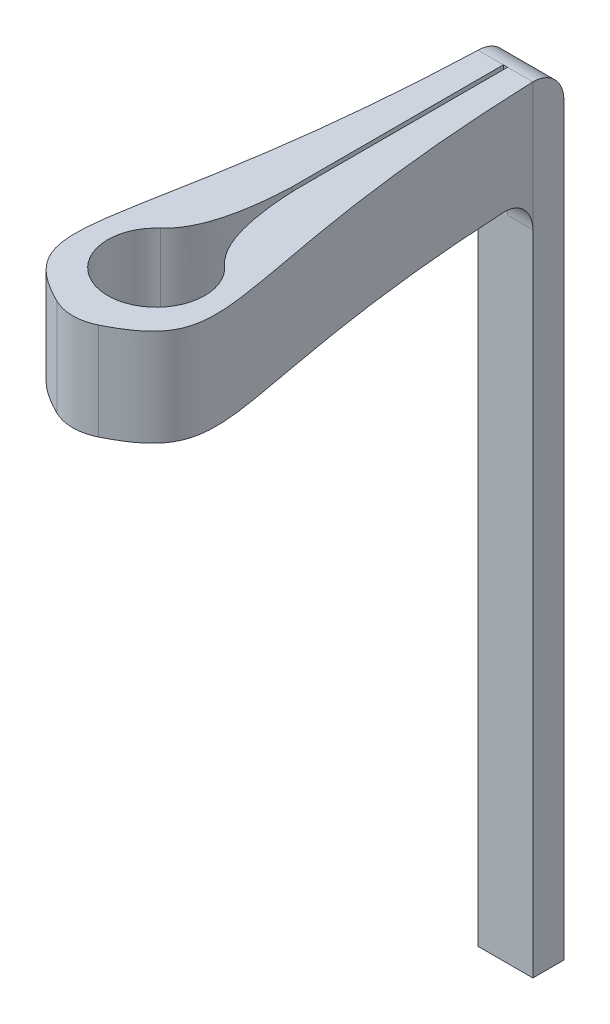
ISO-10303-21;
HEADER;
FILE_DESCRIPTION(('STEP AP214'),'2;1');
FILE_NAME('part.step','',(''),(''),'','','');
FILE_SCHEMA(('AUTOMOTIVE_DESIGN { 1 0 10303 214 1 1 1 1 }'));
ENDSEC;
DATA;
#1=APPLICATION_CONTEXT('core data for automotive mechanical design processes');
#2=APPLICATION_PROTOCOL_DEFINITION('international standard','automotive_design',2000,#1);
#3=PRODUCT_CONTEXT('',#1,'mechanical');
#4=PRODUCT('Part','Part','',(#3));
#5=PRODUCT_RELATED_PRODUCT_CATEGORY('part','',(#4));
#6=PRODUCT_DEFINITION_FORMATION('','',#4);
#7=PRODUCT_DEFINITION_CONTEXT('part definition',#1,'design');
#8=PRODUCT_DEFINITION('design','',#6,#7);
#9=PRODUCT_DEFINITION_SHAPE('','',#8);
#10=(LENGTH_UNIT() NAMED_UNIT(*) SI_UNIT(.MILLI.,.METRE.));
#11=(NAMED_UNIT(*) PLANE_ANGLE_UNIT() SI_UNIT($,.RADIAN.));
#12=(NAMED_UNIT(*) SI_UNIT($,.STERADIAN.) SOLID_ANGLE_UNIT());
#13=UNCERTAINTY_MEASURE_WITH_UNIT(LENGTH_MEASURE(1.E-05),#10,'distance_accuracy_value','');
#14=(GEOMETRIC_REPRESENTATION_CONTEXT(3) GLOBAL_UNCERTAINTY_ASSIGNED_CONTEXT((#13)) GLOBAL_UNIT_ASSIGNED_CONTEXT((#10,
#11,#12)) REPRESENTATION_CONTEXT('',''));
#15=CARTESIAN_POINT('',(0.,0.,0.));
#16=DIRECTION('',(0.,0.,1.));
#17=DIRECTION('',(1.,0.,0.));
#18=AXIS2_PLACEMENT_3D('',#15,#16,#17);
#19=CARTESIAN_POINT('',(0.895808533337032,-1.5875,-13.1387117385729));
#20=CARTESIAN_POINT('',(1.21007447279534,-1.5875,-4.57087153008787));
#21=CARTESIAN_POINT('',(2.7776087579068,-1.5875,-1.08356263840888));
#22=CARTESIAN_POINT('',(3.2771361570606,-1.5875,-0.201945645477048));
#23=CARTESIAN_POINT('',(0.,-1.5875,1.16995363792198));
#24=B_SPLINE_CURVE_WITH_KNOTS('',4,(#19,#20,#21,#22,#23),.UNSPECIFIED.,.F.,.F.,(5,5),(0.,1.),.UNSPECIFIED.);
#25=DIRECTION('',(0.,1.,0.));
#26=VECTOR('',#25,1.);
#27=SURFACE_OF_LINEAR_EXTRUSION('',#24,#26);
#28=CARTESIAN_POINT('',(0.895808533337032,1.5875,-13.1387117385729));
#29=CARTESIAN_POINT('',(1.21007447279534,1.5875,-4.57087153008787));
#30=CARTESIAN_POINT('',(2.7776087579068,1.5875,-1.08356263840888));
#31=CARTESIAN_POINT('',(3.2771361570606,1.5875,-0.201945645477048));
#32=CARTESIAN_POINT('',(0.,1.5875,1.16995363792198));
#33=B_SPLINE_CURVE_WITH_KNOTS('',4,(#28,#29,#30,#31,#32),.UNSPECIFIED.,.F.,.F.,(5,5),(0.,1.),.UNSPECIFIED.);
#34=CARTESIAN_POINT('',(0.895808533337032,1.5875,-13.1387117385729));
#35=VERTEX_POINT('',#34);
#36=CARTESIAN_POINT('',(0.677507544986384,1.5875,0.863468623555458));
#37=VERTEX_POINT('',#36);
#38=EDGE_CURVE('E181',#35,#37,#33,.T.);
#39=ORIENTED_EDGE('',*,*,#38,.T.);
#40=DIRECTION('',(0.,1.,0.));
#41=VECTOR('',#40,1.);
#42=CARTESIAN_POINT('',(0.677507544986435,1.5875,0.863468623555433));
#43=LINE('',#42,#41);
#44=CARTESIAN_POINT('',(0.677507544986384,-1.5875,0.863468623555458));
#45=VERTEX_POINT('',#44);
#46=EDGE_CURVE('E315',#37,#45,#43,.F.);
#47=ORIENTED_EDGE('',*,*,#46,.T.);
#48=CARTESIAN_POINT('',(0.940817771257643,-1.5875,-12.1227117385979));
#49=VERTEX_POINT('',#48);
#50=EDGE_CURVE('E219',#49,#45,#24,.T.);
#51=ORIENTED_EDGE('',*,*,#50,.F.);
#52=CARTESIAN_POINT('',(0.940817770777522,-1.5875,-12.1227117385729));
#53=CARTESIAN_POINT('',(0.939328600907444,-1.58750022204157,-12.1513079520232));
#54=CARTESIAN_POINT('',(0.93785946140498,-1.58870806349856,-12.1798915074532));
#55=CARTESIAN_POINT('',(0.934969141549042,-1.59352728075537,-12.2368564827357));
#56=CARTESIAN_POINT('',(0.933547959222119,-1.59713855752622,-12.2652379108677));
#57=CARTESIAN_POINT('',(0.929372489614877,-1.61154468895069,-12.3497267497475));
#58=CARTESIAN_POINT('',(0.926701444796436,-1.62591193266797,-12.4052717238406));
#59=CARTESIAN_POINT('',(0.921643753745075,-1.66377972410457,-12.51316937762));
#60=CARTESIAN_POINT('',(0.919257252531395,-1.68728490324401,-12.5655204229221));
#61=CARTESIAN_POINT('',(0.914807242295324,-1.74276538676793,-12.6655367231498));
#62=CARTESIAN_POINT('',(0.912743671302016,-1.77473906285321,-12.7132028764604));
#63=CARTESIAN_POINT('',(0.908964344849778,-1.84621844603389,-12.8024541281653));
#64=CARTESIAN_POINT('',(0.90724834479178,-1.88571881804383,-12.8440434972439));
#65=CARTESIAN_POINT('',(0.904172769237229,-1.97117878853448,-12.9200134206932));
#66=CARTESIAN_POINT('',(0.90281318548842,-2.01713823742763,-12.9543941419651));
#67=CARTESIAN_POINT('',(0.901044949174675,-2.08986741994529,-12.9997850900849));
#68=CARTESIAN_POINT('',(0.900500579509933,-2.11475181333681,-13.0138893566973));
#69=CARTESIAN_POINT('',(0.899501998730722,-2.16559629009388,-13.0399423328207));
#70=CARTESIAN_POINT('',(0.899047707887298,-2.19155539740104,-13.0518929476717));
#71=CARTESIAN_POINT('',(0.897819342422165,-2.27080393556553,-13.0843873593775));
#72=CARTESIAN_POINT('',(0.897178549331054,-2.32551572997143,-13.101605585224));
#73=CARTESIAN_POINT('',(0.896412642565198,-2.41771298811855,-13.1222827675783));
#74=CARTESIAN_POINT('',(0.896185875363191,-2.45462540078673,-13.1284396437794));
#75=CARTESIAN_POINT('',(0.895884062655519,-2.52885104385581,-13.136652425781));
#76=CARTESIAN_POINT('',(0.895808801597605,-2.56616362877481,-13.1387141578079));
#77=CARTESIAN_POINT('',(0.895808533337032,-2.6035,-13.1387117385729));
#78=B_SPLINE_CURVE_WITH_KNOTS('',3,(#52,#53,#54,#55,#56,#57,#58,#59,#60,#61,#62,#63,#64,#65,#66,
#67,#68,#69,#70,#71,#72,#73,#74,#75,#76,#77),.UNSPECIFIED.,.F.,.F.,(4,2,2,2,2,2,2,2,2,2,2,2,4),
(0.,0.0858522069243643,0.171700876690702,0.343122365469708,0.514630850066166,0.68610638139503,
0.857460816266934,1.02881128334724,1.11454841588172,1.20020932019451,1.37135254542086,
1.4834174901905,1.59532288386267),.UNSPECIFIED.);
#79=CARTESIAN_POINT('',(0.895808533337032,-2.6035,-13.1387117385729));
#80=VERTEX_POINT('',#79);
#81=EDGE_CURVE('E364',#49,#80,#78,.T.);
#82=ORIENTED_EDGE('',*,*,#81,.T.);
#83=DIRECTION('',(0.,1.,0.));
#84=VECTOR('',#83,1.);
#85=CARTESIAN_POINT('',(0.895808533337032,-1.5875,-13.1387117385729));
#86=LINE('',#85,#84);
#87=EDGE_CURVE('E55',#80,#35,#86,.T.);
#88=ORIENTED_EDGE('',*,*,#87,.T.);
#89=EDGE_LOOP('',(#39,#47,#51,#82,#88));
#90=FACE_BOUND('',#89,.T.);
#91=ADVANCED_FACE('F34',(#90),#27,.F.);
#92=CARTESIAN_POINT('',(-0.895808533337031,-1.5875,-13.1387117385729));
#93=CARTESIAN_POINT('',(-1.21007447279534,-1.5875,-4.57087153008787));
#94=CARTESIAN_POINT('',(-2.7776087579068,-1.5875,-1.08356263840888));
#95=CARTESIAN_POINT('',(-3.2771361570606,-1.5875,-0.201945645477048));
#96=CARTESIAN_POINT('',(0.,-1.5875,1.16995363792198));
#97=B_SPLINE_CURVE_WITH_KNOTS('',4,(#92,#93,#94,#95,#96),.UNSPECIFIED.,.F.,.F.,(5,5),(0.,1.),.UNSPECIFIED.);
#98=DIRECTION('',(0.,1.,0.));
#99=VECTOR('',#98,1.);
#100=SURFACE_OF_LINEAR_EXTRUSION('',#97,#99);
#101=DIRECTION('',(0.,1.,0.));
#102=VECTOR('',#101,1.);
#103=CARTESIAN_POINT('',(-0.895808533337031,-1.5875,-13.1387117385729));
#104=LINE('',#103,#102);
#105=CARTESIAN_POINT('',(-0.895808533337031,-2.6035,-13.1387117385729));
#106=VERTEX_POINT('',#105);
#107=CARTESIAN_POINT('',(-0.895808533337031,1.5875,-13.1387117385729));
#108=VERTEX_POINT('',#107);
#109=EDGE_CURVE('E338',#106,#108,#104,.T.);
#110=ORIENTED_EDGE('',*,*,#109,.F.);
#111=CARTESIAN_POINT('',(-0.895808533337031,-2.6035,-13.1387117385729));
#112=CARTESIAN_POINT('',(-0.895808644521803,-2.57493082215817,-13.138711544934));
#113=CARTESIAN_POINT('',(-0.895852749616112,-2.54637534498942,-13.1375059587632));
#114=CARTESIAN_POINT('',(-0.8960293760861,-2.48946876532865,-13.1326964350414));
#115=CARTESIAN_POINT('',(-0.896161893251777,-2.46111765317017,-13.1290926116894));
#116=CARTESIAN_POINT('',(-0.896692122889837,-2.37672593210134,-13.1147182255634));
#117=CARTESIAN_POINT('',(-0.897222511499748,-2.32125069622909,-13.1003846504929));
#118=CARTESIAN_POINT('',(-0.898639752593142,-2.21349767100376,-13.062615877911));
#119=CARTESIAN_POINT('',(-0.899526774793042,-2.1612214176636,-13.0391763471955));
#120=CARTESIAN_POINT('',(-0.901659536102315,-2.06134822821983,-12.9838637587255));
#121=CARTESIAN_POINT('',(-0.902905213284322,-2.01375048619993,-12.9519921569764));
#122=CARTESIAN_POINT('',(-0.905754096178373,-1.92457328936663,-12.8807197751934));
#123=CARTESIAN_POINT('',(-0.90735741181802,-1.88299569146331,-12.841316680733));
#124=CARTESIAN_POINT('',(-0.910914628002094,-1.8070333732752,-12.7560769076421));
#125=CARTESIAN_POINT('',(-0.912868525221261,-1.77264858477344,-12.7102402900345));
#126=CARTESIAN_POINT('',(-0.916046154230379,-1.72720747571318,-12.6376748721264));
#127=CARTESIAN_POINT('',(-0.917147881131955,-1.71307061112935,-12.612821033248));
#128=CARTESIAN_POINT('',(-0.91942893394455,-1.68695104376555,-12.5620395102616));
#129=CARTESIAN_POINT('',(-0.920608189875637,-1.67496643379838,-12.536112802183));
#130=CARTESIAN_POINT('',(-0.924257339092153,-1.64236563386945,-12.4569627280144));
#131=CARTESIAN_POINT('',(-0.926840763556043,-1.62507157727108,-12.4023199715406));
#132=CARTESIAN_POINT('',(-0.931331467141856,-1.60418275921374,-12.3099181168085));
#133=CARTESIAN_POINT('',(-0.933170568992069,-1.59793047249544,-12.2727244503796));
#134=CARTESIAN_POINT('',(-0.936934076125651,-1.58959077551676,-12.1979312915133));
#135=CARTESIAN_POINT('',(-0.938858355772612,-1.58749742722677,-12.1603324548522));
#136=CARTESIAN_POINT('',(-0.94081777125773,-1.5875,-12.1227117385963));
#137=B_SPLINE_CURVE_WITH_KNOTS('',3,(#111,#112,#113,#114,#115,#116,#117,#118,#119,#120,#121,
#122,#123,#124,#125,#126,#127,#128,#129,#130,#131,#132,#133,#134,#135,#136),.UNSPECIFIED.,.F.,
.F.,(4,2,2,2,2,2,2,2,2,2,2,2,4),(0.,0.0856548572810295,0.171305636144386,0.34232214208756,
0.513420128655629,0.684488590190824,0.855609705801621,1.02672919841746,1.11248320510674,
1.19816084316029,1.36934325509694,1.48241519898036,1.59532558518064),.UNSPECIFIED.);
#138=CARTESIAN_POINT('',(-0.940817771257643,-1.5875,-12.1227117385979));
#139=VERTEX_POINT('',#138);
#140=EDGE_CURVE('E11',#106,#139,#137,.T.);
#141=ORIENTED_EDGE('',*,*,#140,.T.);
#142=CARTESIAN_POINT('',(-0.677507544986381,-1.5875,0.863468623555459));
#143=VERTEX_POINT('',#142);
#144=EDGE_CURVE('E242',#139,#143,#97,.T.);
#145=ORIENTED_EDGE('',*,*,#144,.T.);
#146=DIRECTION('',(0.,1.,0.));
#147=VECTOR('',#146,1.);
#148=CARTESIAN_POINT('',(-0.677507544986433,-1.5875,0.863468623555434));
#149=LINE('',#148,#147);
#150=CARTESIAN_POINT('',(-0.677507544986381,1.5875,0.863468623555459));
#151=VERTEX_POINT('',#150);
#152=EDGE_CURVE('E330',#143,#151,#149,.T.);
#153=ORIENTED_EDGE('',*,*,#152,.T.);
#154=CARTESIAN_POINT('',(-0.895808533337031,1.5875,-13.1387117385729));
#155=CARTESIAN_POINT('',(-1.21007447279534,1.5875,-4.57087153008787));
#156=CARTESIAN_POINT('',(-2.7776087579068,1.5875,-1.08356263840888));
#157=CARTESIAN_POINT('',(-3.2771361570606,1.5875,-0.201945645477048));
#158=CARTESIAN_POINT('',(0.,1.5875,1.16995363792198));
#159=B_SPLINE_CURVE_WITH_KNOTS('',4,(#154,#155,#156,#157,#158),.UNSPECIFIED.,.F.,.F.,(5,5),(0.,
1.),.UNSPECIFIED.);
#160=EDGE_CURVE('E214',#108,#151,#159,.T.);
#161=ORIENTED_EDGE('',*,*,#160,.F.);
#162=EDGE_LOOP('',(#110,#141,#145,#153,#161));
#163=FACE_BOUND('',#162,.T.);
#164=ADVANCED_FACE('F260',(#163),#100,.T.);
#165=CARTESIAN_POINT('',(-0.0682967636124147,-1.5875,0.));
#166=DIRECTION('',(-1.,0.,0.));
#167=DIRECTION('',(0.,0.,1.));
#168=AXIS2_PLACEMENT_3D('',#165,#166,#167);
#169=PLANE('',#168);
#170=DIRECTION('',(0.,1.,0.));
#171=VECTOR('',#170,1.);
#172=CARTESIAN_POINT('',(-0.0682967636124164,-1.5875,-13.1387117385729));
#173=LINE('',#172,#171);
#174=CARTESIAN_POINT('',(-0.0682967636124164,-2.6035,-13.1387117385729));
#175=VERTEX_POINT('',#174);
#176=CARTESIAN_POINT('',(-0.0682967636124159,1.5875,-13.1387117385729));
#177=VERTEX_POINT('',#176);
#178=EDGE_CURVE('E254',#175,#177,#173,.T.);
#179=ORIENTED_EDGE('',*,*,#178,.T.);
#180=DIRECTION('',(0.,0.,1.));
#181=VECTOR('',#180,1.);
#182=CARTESIAN_POINT('',(-0.0682967636124147,1.5875,0.));
#183=LINE('',#182,#181);
#184=CARTESIAN_POINT('',(-0.0682967636124155,1.5875,-6.21461869480893));
#185=VERTEX_POINT('',#184);
#186=EDGE_CURVE('E208',#177,#185,#183,.T.);
#187=ORIENTED_EDGE('',*,*,#186,.T.);
#188=DIRECTION('',(0.,1.,0.));
#189=VECTOR('',#188,1.);
#190=CARTESIAN_POINT('',(-0.0682967636124155,-1.5875,-6.21461869480893));
#191=LINE('',#190,#189);
#192=CARTESIAN_POINT('',(-0.0682967636124155,-1.5875,-6.21461869480893));
#193=VERTEX_POINT('',#192);
#194=EDGE_CURVE('E391',#193,#185,#191,.T.);
#195=ORIENTED_EDGE('',*,*,#194,.F.);
#196=DIRECTION('',(0.,0.,1.));
#197=VECTOR('',#196,1.);
#198=CARTESIAN_POINT('',(-0.0682967636124147,-1.5875,0.));
#199=LINE('',#198,#197);
#200=CARTESIAN_POINT('',(-0.0682967636124162,-1.5875,-12.1227117385729));
#201=VERTEX_POINT('',#200);
#202=EDGE_CURVE('E245',#201,#193,#199,.T.);
#203=ORIENTED_EDGE('',*,*,#202,.F.);
#204=CARTESIAN_POINT('',(-0.0682967636124162,-2.6035,-12.1227117385729));
#205=DIRECTION('',(-1.,0.,0.));
#206=DIRECTION('',(0.,0.,1.));
#207=AXIS2_PLACEMENT_3D('',#204,#205,#206);
#208=CIRCLE('',#207,1.016);
#209=EDGE_CURVE('E48',#201,#175,#208,.T.);
#210=ORIENTED_EDGE('',*,*,#209,.T.);
#211=EDGE_LOOP('',(#179,#187,#195,#203,#210));
#212=FACE_BOUND('',#211,.T.);
#213=ADVANCED_FACE('F265',(#212),#169,.F.);
#214=CARTESIAN_POINT('',(-1.05409896108141,-1.5875,-2.89573812001823));
#215=CARTESIAN_POINT('',(-0.161537853761285,-1.5875,-3.68834707179423));
#216=CARTESIAN_POINT('',(-0.0682967636124155,-1.5875,-6.21461869480893));
#217=B_SPLINE_CURVE_WITH_KNOTS('',2,(#214,#215,#216),.UNSPECIFIED.,.F.,.F.,(3,3),(0.,1.),.UNSPECIFIED.);
#218=DIRECTION('',(0.,1.,0.));
#219=VECTOR('',#218,1.);
#220=SURFACE_OF_LINEAR_EXTRUSION('',#217,#219);
#221=ORIENTED_EDGE('',*,*,#194,.T.);
#222=CARTESIAN_POINT('',(-1.05409896108141,1.5875,-2.89573812001823));
#223=CARTESIAN_POINT('',(-0.161537853761285,1.5875,-3.68834707179423));
#224=CARTESIAN_POINT('',(-0.0682967636124155,1.5875,-6.21461869480893));
#225=B_SPLINE_CURVE_WITH_KNOTS('',2,(#222,#223,#224),.UNSPECIFIED.,.F.,.F.,(3,3),(0.,1.),.UNSPECIFIED.);
#226=CARTESIAN_POINT('',(-1.05409896108141,1.5875,-2.89573812001823));
#227=VERTEX_POINT('',#226);
#228=EDGE_CURVE('E203',#227,#185,#225,.T.);
#229=ORIENTED_EDGE('',*,*,#228,.F.);
#230=DIRECTION('',(0.,1.,0.));
#231=VECTOR('',#230,1.);
#232=CARTESIAN_POINT('',(-1.05409896108141,-1.5875,-2.89573812001823));
#233=LINE('',#232,#231);
#234=CARTESIAN_POINT('',(-1.05409896108141,-1.5875,-2.89573812001823));
#235=VERTEX_POINT('',#234);
#236=EDGE_CURVE('E390',#235,#227,#233,.T.);
#237=ORIENTED_EDGE('',*,*,#236,.F.);
#238=EDGE_CURVE('E278',#235,#193,#217,.T.);
#239=ORIENTED_EDGE('',*,*,#238,.T.);
#240=EDGE_LOOP('',(#221,#229,#237,#239));
#241=FACE_BOUND('',#240,.T.);
#242=ADVANCED_FACE('F271',(#241),#220,.T.);
#243=CARTESIAN_POINT('',(0.,-1.5875,-1.70871173857294));
#244=DIRECTION('',(0.,1.,0.));
#245=DIRECTION('',(0.,0.,1.));
#246=AXIS2_PLACEMENT_3D('',#243,#244,#245);
#247=CYLINDRICAL_SURFACE('',#246,1.5875);
#248=ORIENTED_EDGE('',*,*,#236,.T.);
#249=CARTESIAN_POINT('',(0.,1.5875,-1.70871173857294));
#250=DIRECTION('',(0.,1.,0.));
#251=DIRECTION('',(0.,0.,1.));
#252=AXIS2_PLACEMENT_3D('',#249,#250,#251);
#253=CIRCLE('',#252,1.5875);
#254=CARTESIAN_POINT('',(1.05409896108141,1.5875,-2.89573812001823));
#255=VERTEX_POINT('',#254);
#256=EDGE_CURVE('E197',#227,#255,#253,.T.);
#257=ORIENTED_EDGE('',*,*,#256,.T.);
#258=DIRECTION('',(0.,1.,0.));
#259=VECTOR('',#258,1.);
#260=CARTESIAN_POINT('',(1.05409896108141,-1.5875,-2.89573812001823));
#261=LINE('',#260,#259);
#262=CARTESIAN_POINT('',(1.05409896108141,-1.5875,-2.89573812001823));
#263=VERTEX_POINT('',#262);
#264=EDGE_CURVE('E388',#263,#255,#261,.T.);
#265=ORIENTED_EDGE('',*,*,#264,.F.);
#266=CARTESIAN_POINT('',(0.,-1.5875,-1.70871173857294));
#267=DIRECTION('',(0.,1.,0.));
#268=DIRECTION('',(0.,0.,1.));
#269=AXIS2_PLACEMENT_3D('',#266,#267,#268);
#270=CIRCLE('',#269,1.5875);
#271=EDGE_CURVE('E284',#235,#263,#270,.T.);
#272=ORIENTED_EDGE('',*,*,#271,.F.);
#273=EDGE_LOOP('',(#248,#257,#265,#272));
#274=FACE_BOUND('',#273,.T.);
#275=ADVANCED_FACE('F275',(#274),#247,.F.);
#276=CARTESIAN_POINT('',(1.05409896108141,-1.5875,-2.89573812001823));
#277=CARTESIAN_POINT('',(0.161537853761285,-1.5875,-3.68834707179423));
#278=CARTESIAN_POINT('',(0.0682967636124155,-1.5875,-6.21461869480893));
#279=B_SPLINE_CURVE_WITH_KNOTS('',2,(#276,#277,#278),.UNSPECIFIED.,.F.,.F.,(3,3),(0.,1.),.UNSPECIFIED.);
#280=DIRECTION('',(0.,1.,0.));
#281=VECTOR('',#280,1.);
#282=SURFACE_OF_LINEAR_EXTRUSION('',#279,#281);
#283=ORIENTED_EDGE('',*,*,#264,.T.);
#284=CARTESIAN_POINT('',(1.05409896108141,1.5875,-2.89573812001823));
#285=CARTESIAN_POINT('',(0.161537853761285,1.5875,-3.68834707179423));
#286=CARTESIAN_POINT('',(0.0682967636124155,1.5875,-6.21461869480893));
#287=B_SPLINE_CURVE_WITH_KNOTS('',2,(#284,#285,#286),.UNSPECIFIED.,.F.,.F.,(3,3),(0.,1.),.UNSPECIFIED.);
#288=CARTESIAN_POINT('',(0.0682967636124155,1.5875,-6.21461869480893));
#289=VERTEX_POINT('',#288);
#290=EDGE_CURVE('E192',#255,#289,#287,.T.);
#291=ORIENTED_EDGE('',*,*,#290,.T.);
#292=DIRECTION('',(0.,1.,0.));
#293=VECTOR('',#292,1.);
#294=CARTESIAN_POINT('',(0.0682967636124155,-1.5875,-6.21461869480893));
#295=LINE('',#294,#293);
#296=CARTESIAN_POINT('',(0.0682967636124155,-1.5875,-6.21461869480893));
#297=VERTEX_POINT('',#296);
#298=EDGE_CURVE('E386',#297,#289,#295,.T.);
#299=ORIENTED_EDGE('',*,*,#298,.F.);
#300=EDGE_CURVE('E288',#263,#297,#279,.T.);
#301=ORIENTED_EDGE('',*,*,#300,.F.);
#302=EDGE_LOOP('',(#283,#291,#299,#301));
#303=FACE_BOUND('',#302,.T.);
#304=ADVANCED_FACE('F296',(#303),#282,.F.);
#305=CARTESIAN_POINT('',(0.0682967636124147,-1.5875,0.));
#306=DIRECTION('',(-1.,0.,0.));
#307=DIRECTION('',(0.,0.,1.));
#308=AXIS2_PLACEMENT_3D('',#305,#306,#307);
#309=PLANE('',#308);
#310=ORIENTED_EDGE('',*,*,#298,.T.);
#311=DIRECTION('',(0.,0.,1.));
#312=VECTOR('',#311,1.);
#313=CARTESIAN_POINT('',(0.0682967636124147,1.5875,0.));
#314=LINE('',#313,#312);
#315=CARTESIAN_POINT('',(0.0682967636124164,1.5875,-13.1387117385729));
#316=VERTEX_POINT('',#315);
#317=EDGE_CURVE('E186',#316,#289,#314,.T.);
#318=ORIENTED_EDGE('',*,*,#317,.F.);
#319=DIRECTION('',(0.,1.,0.));
#320=VECTOR('',#319,1.);
#321=CARTESIAN_POINT('',(0.0682967636124164,-1.5875,-13.1387117385729));
#322=LINE('',#321,#320);
#323=CARTESIAN_POINT('',(0.0682967636124164,-2.6035,-13.1387117385729));
#324=VERTEX_POINT('',#323);
#325=EDGE_CURVE('E335',#324,#316,#322,.T.);
#326=ORIENTED_EDGE('',*,*,#325,.F.);
#327=CARTESIAN_POINT('',(0.0682967636124163,-2.6035,-12.1227117385729));
#328=DIRECTION('',(-1.,0.,0.));
#329=DIRECTION('',(0.,0.,1.));
#330=AXIS2_PLACEMENT_3D('',#327,#328,#329);
#331=CIRCLE('',#330,1.016);
#332=CARTESIAN_POINT('',(0.0682967636124162,-1.5875,-12.1227117385729));
#333=VERTEX_POINT('',#332);
#334=EDGE_CURVE('E362',#324,#333,#331,.F.);
#335=ORIENTED_EDGE('',*,*,#334,.T.);
#336=DIRECTION('',(0.,0.,1.));
#337=VECTOR('',#336,1.);
#338=CARTESIAN_POINT('',(0.0682967636124147,-1.5875,0.));
#339=LINE('',#338,#337);
#340=EDGE_CURVE('E227',#333,#297,#339,.T.);
#341=ORIENTED_EDGE('',*,*,#340,.T.);
#342=EDGE_LOOP('',(#310,#318,#326,#335,#341));
#343=FACE_BOUND('',#342,.T.);
#344=ADVANCED_FACE('F298',(#343),#309,.T.);
#345=CARTESIAN_POINT('',(0.,-1.5875,0.));
#346=DIRECTION('',(0.,1.,0.));
#347=DIRECTION('',(0.,0.,1.));
#348=AXIS2_PLACEMENT_3D('',#345,#346,#347);
#349=PLANE('',#348);
#350=ORIENTED_EDGE('',*,*,#340,.F.);
#351=DIRECTION('',(-1.,0.,0.));
#352=VECTOR('',#351,1.);
#353=CARTESIAN_POINT('',(0.,-1.5875,-12.1227117385729));
#354=LINE('',#353,#352);
#355=EDGE_CURVE('E345',#333,#49,#354,.F.);
#356=ORIENTED_EDGE('',*,*,#355,.T.);
#357=ORIENTED_EDGE('',*,*,#50,.T.);
#358=CARTESIAN_POINT('',(0.,-1.5875,-0.501653908119454));
#359=DIRECTION('',(0.,1.,0.));
#360=DIRECTION('',(0.,0.,1.));
#361=AXIS2_PLACEMENT_3D('',#358,#359,#360);
#362=CIRCLE('',#361,1.524);
#363=EDGE_CURVE('E327',#45,#143,#362,.F.);
#364=ORIENTED_EDGE('',*,*,#363,.T.);
#365=ORIENTED_EDGE('',*,*,#144,.F.);
#366=DIRECTION('',(1.,0.,0.));
#367=VECTOR('',#366,1.);
#368=CARTESIAN_POINT('',(0.,-1.5875,-12.1227117385729));
#369=LINE('',#368,#367);
#370=EDGE_CURVE('E246',#139,#201,#369,.T.);
#371=ORIENTED_EDGE('',*,*,#370,.T.);
#372=ORIENTED_EDGE('',*,*,#202,.T.);
#373=ORIENTED_EDGE('',*,*,#238,.F.);
#374=ORIENTED_EDGE('',*,*,#271,.T.);
#375=ORIENTED_EDGE('',*,*,#300,.T.);
#376=EDGE_LOOP('',(#350,#356,#357,#364,#365,#371,#372,#373,#374,#375));
#377=FACE_BOUND('',#376,.T.);
#378=ADVANCED_FACE('F267',(#377),#349,.F.);
#379=CARTESIAN_POINT('',(0.,1.5875,0.));
#380=DIRECTION('',(0.,1.,0.));
#381=DIRECTION('',(0.,0.,1.));
#382=AXIS2_PLACEMENT_3D('',#379,#380,#381);
#383=PLANE('',#382);
#384=ORIENTED_EDGE('',*,*,#38,.F.);
#385=DIRECTION('',(-1.,0.,0.));
#386=VECTOR('',#385,1.);
#387=CARTESIAN_POINT('',(0.,1.5875,-13.1387117385729));
#388=LINE('',#387,#386);
#389=EDGE_CURVE('E352',#35,#316,#388,.T.);
#390=ORIENTED_EDGE('',*,*,#389,.T.);
#391=ORIENTED_EDGE('',*,*,#317,.T.);
#392=ORIENTED_EDGE('',*,*,#290,.F.);
#393=ORIENTED_EDGE('',*,*,#256,.F.);
#394=ORIENTED_EDGE('',*,*,#228,.T.);
#395=ORIENTED_EDGE('',*,*,#186,.F.);
#396=DIRECTION('',(-1.,0.,0.));
#397=VECTOR('',#396,1.);
#398=CARTESIAN_POINT('',(0.,1.5875,-13.1387117385729));
#399=LINE('',#398,#397);
#400=EDGE_CURVE('E349',#177,#108,#399,.T.);
#401=ORIENTED_EDGE('',*,*,#400,.T.);
#402=ORIENTED_EDGE('',*,*,#160,.T.);
#403=CARTESIAN_POINT('',(0.,1.5875,-0.501653908119454));
#404=DIRECTION('',(0.,1.,0.));
#405=DIRECTION('',(0.,0.,1.));
#406=AXIS2_PLACEMENT_3D('',#403,#404,#405);
#407=CIRCLE('',#406,1.524);
#408=EDGE_CURVE('E324',#151,#37,#407,.T.);
#409=ORIENTED_EDGE('',*,*,#408,.T.);
#410=EDGE_LOOP('',(#384,#390,#391,#392,#393,#394,#395,#401,#402,#409));
#411=FACE_BOUND('',#410,.T.);
#412=ADVANCED_FACE('F305',(#411),#383,.T.);
#413=CARTESIAN_POINT('',(0.,0.,-0.501653908119454));
#414=DIRECTION('',(0.,1.,0.));
#415=DIRECTION('',(0.,0.,1.));
#416=AXIS2_PLACEMENT_3D('',#413,#414,#415);
#417=CYLINDRICAL_SURFACE('',#416,1.524);
#418=ORIENTED_EDGE('',*,*,#363,.F.);
#419=ORIENTED_EDGE('',*,*,#46,.F.);
#420=ORIENTED_EDGE('',*,*,#408,.F.);
#421=ORIENTED_EDGE('',*,*,#152,.F.);
#422=EDGE_LOOP('',(#418,#419,#420,#421));
#423=FACE_BOUND('',#422,.T.);
#424=ADVANCED_FACE('F322',(#423),#417,.T.);
#425=CARTESIAN_POINT('',(0.895808533337032,0.,-13.1387117385729));
#426=DIRECTION('',(0.,0.,1.));
#427=DIRECTION('',(1.,0.,0.));
#428=AXIS2_PLACEMENT_3D('',#425,#426,#427);
#429=PLANE('',#428);
#430=DIRECTION('',(0.,1.,0.));
#431=VECTOR('',#430,1.);
#432=CARTESIAN_POINT('',(0.895808533337032,0.,-13.1387117385729));
#433=LINE('',#432,#431);
#434=CARTESIAN_POINT('',(0.895808533337032,-23.8125,-13.1387117385729));
#435=VERTEX_POINT('',#434);
#436=EDGE_CURVE('E169',#435,#80,#433,.T.);
#437=ORIENTED_EDGE('',*,*,#436,.T.);
#438=DIRECTION('',(-1.,0.,0.));
#439=VECTOR('',#438,1.);
#440=CARTESIAN_POINT('',(0.895808533337032,-2.6035,-13.1387117385729));
#441=LINE('',#440,#439);
#442=EDGE_CURVE('E240',#80,#324,#441,.T.);
#443=ORIENTED_EDGE('',*,*,#442,.T.);
#444=ORIENTED_EDGE('',*,*,#325,.T.);
#445=DIRECTION('',(-1.,0.,0.));
#446=VECTOR('',#445,1.);
#447=CARTESIAN_POINT('',(0.895808533337032,1.5875,-13.1387117385729));
#448=LINE('',#447,#446);
#449=EDGE_CURVE('E150',#316,#177,#448,.T.);
#450=ORIENTED_EDGE('',*,*,#449,.T.);
#451=ORIENTED_EDGE('',*,*,#178,.F.);
#452=DIRECTION('',(1.,0.,0.));
#453=VECTOR('',#452,1.);
#454=CARTESIAN_POINT('',(0.895808533337032,-2.6035,-13.1387117385729));
#455=LINE('',#454,#453);
#456=EDGE_CURVE('E158',#175,#106,#455,.F.);
#457=ORIENTED_EDGE('',*,*,#456,.T.);
#458=DIRECTION('',(0.,1.,0.));
#459=VECTOR('',#458,1.);
#460=CARTESIAN_POINT('',(-0.895808533337031,0.,-13.1387117385729));
#461=LINE('',#460,#459);
#462=CARTESIAN_POINT('',(-0.895808533337031,-23.8125,-13.1387117385729));
#463=VERTEX_POINT('',#462);
#464=EDGE_CURVE('E155',#463,#106,#461,.T.);
#465=ORIENTED_EDGE('',*,*,#464,.F.);
#466=DIRECTION('',(-1.,0.,0.));
#467=VECTOR('',#466,1.);
#468=CARTESIAN_POINT('',(0.895808533337032,-23.8125,-13.1387117385729));
#469=LINE('',#468,#467);
#470=EDGE_CURVE('E141',#435,#463,#469,.T.);
#471=ORIENTED_EDGE('',*,*,#470,.F.);
#472=EDGE_LOOP('',(#437,#443,#444,#450,#451,#457,#465,#471));
#473=FACE_BOUND('',#472,.T.);
#474=ADVANCED_FACE('F156',(#473),#429,.T.);
#475=CARTESIAN_POINT('',(0.895808533337032,0.,-14.1547117385729));
#476=DIRECTION('',(0.,0.,-1.));
#477=DIRECTION('',(0.,1.,0.));
#478=AXIS2_PLACEMENT_3D('',#475,#476,#477);
#479=PLANE('',#478);
#480=DIRECTION('',(0.,-1.,0.));
#481=VECTOR('',#480,1.);
#482=CARTESIAN_POINT('',(-0.895808533337031,0.,-14.1547117385729));
#483=LINE('',#482,#481);
#484=CARTESIAN_POINT('',(-0.895808533337031,0.5715,-14.1547117385729));
#485=VERTEX_POINT('',#484);
#486=CARTESIAN_POINT('',(-0.895808533337031,-23.8125,-14.1547117385729));
#487=VERTEX_POINT('',#486);
#488=EDGE_CURVE('E162',#485,#487,#483,.T.);
#489=ORIENTED_EDGE('',*,*,#488,.F.);
#490=DIRECTION('',(-1.,0.,0.));
#491=VECTOR('',#490,1.);
#492=CARTESIAN_POINT('',(0.895808533337032,0.5715,-14.1547117385729));
#493=LINE('',#492,#491);
#494=CARTESIAN_POINT('',(0.895808533337032,0.5715,-14.1547117385729));
#495=VERTEX_POINT('',#494);
#496=EDGE_CURVE('E358',#485,#495,#493,.F.);
#497=ORIENTED_EDGE('',*,*,#496,.T.);
#498=DIRECTION('',(0.,-1.,0.));
#499=VECTOR('',#498,1.);
#500=CARTESIAN_POINT('',(0.895808533337032,0.,-14.1547117385729));
#501=LINE('',#500,#499);
#502=CARTESIAN_POINT('',(0.895808533337032,-23.8125,-14.1547117385729));
#503=VERTEX_POINT('',#502);
#504=EDGE_CURVE('E167',#495,#503,#501,.T.);
#505=ORIENTED_EDGE('',*,*,#504,.T.);
#506=DIRECTION('',(-1.,0.,0.));
#507=VECTOR('',#506,1.);
#508=CARTESIAN_POINT('',(0.895808533337032,-23.8125,-14.1547117385729));
#509=LINE('',#508,#507);
#510=EDGE_CURVE('E151',#503,#487,#509,.T.);
#511=ORIENTED_EDGE('',*,*,#510,.T.);
#512=EDGE_LOOP('',(#489,#497,#505,#511));
#513=FACE_BOUND('',#512,.T.);
#514=ADVANCED_FACE('F403',(#513),#479,.T.);
#515=CARTESIAN_POINT('',(0.895808533337032,-23.8125,0.));
#516=DIRECTION('',(0.,1.,0.));
#517=DIRECTION('',(0.,0.,1.));
#518=AXIS2_PLACEMENT_3D('',#515,#516,#517);
#519=PLANE('',#518);
#520=ORIENTED_EDGE('',*,*,#470,.T.);
#521=DIRECTION('',(0.,0.,-1.));
#522=VECTOR('',#521,1.);
#523=CARTESIAN_POINT('',(-0.895808533337031,-23.8125,0.));
#524=LINE('',#523,#522);
#525=EDGE_CURVE('E146',#463,#487,#524,.T.);
#526=ORIENTED_EDGE('',*,*,#525,.T.);
#527=ORIENTED_EDGE('',*,*,#510,.F.);
#528=DIRECTION('',(0.,0.,-1.));
#529=VECTOR('',#528,1.);
#530=CARTESIAN_POINT('',(0.895808533337032,-23.8125,0.));
#531=LINE('',#530,#529);
#532=EDGE_CURVE('E148',#435,#503,#531,.T.);
#533=ORIENTED_EDGE('',*,*,#532,.F.);
#534=EDGE_LOOP('',(#520,#526,#527,#533));
#535=FACE_BOUND('',#534,.T.);
#536=ADVANCED_FACE('F143',(#535),#519,.F.);
#537=CARTESIAN_POINT('',(0.895808533337032,0.,0.));
#538=DIRECTION('',(1.,0.,0.));
#539=DIRECTION('',(0.,0.,-1.));
#540=AXIS2_PLACEMENT_3D('',#537,#538,#539);
#541=PLANE('',#540);
#542=ORIENTED_EDGE('',*,*,#504,.F.);
#543=CARTESIAN_POINT('',(0.895808533337032,0.5715,-13.1387117385729));
#544=DIRECTION('',(1.,0.,0.));
#545=DIRECTION('',(0.,0.,-1.));
#546=AXIS2_PLACEMENT_3D('',#543,#544,#545);
#547=CIRCLE('',#546,1.016);
#548=EDGE_CURVE('E360',#495,#35,#547,.T.);
#549=ORIENTED_EDGE('',*,*,#548,.T.);
#550=ORIENTED_EDGE('',*,*,#87,.F.);
#551=ORIENTED_EDGE('',*,*,#436,.F.);
#552=ORIENTED_EDGE('',*,*,#532,.T.);
#553=EDGE_LOOP('',(#542,#549,#550,#551,#552));
#554=FACE_BOUND('',#553,.T.);
#555=ADVANCED_FACE('F405',(#554),#541,.T.);
#556=CARTESIAN_POINT('',(-0.895808533337031,0.,0.));
#557=DIRECTION('',(1.,0.,0.));
#558=DIRECTION('',(0.,0.,-1.));
#559=AXIS2_PLACEMENT_3D('',#556,#557,#558);
#560=PLANE('',#559);
#561=ORIENTED_EDGE('',*,*,#109,.T.);
#562=CARTESIAN_POINT('',(-0.895808533337031,0.5715,-13.1387117385729));
#563=DIRECTION('',(1.,0.,0.));
#564=DIRECTION('',(0.,0.,-1.));
#565=AXIS2_PLACEMENT_3D('',#562,#563,#564);
#566=CIRCLE('',#565,1.016);
#567=EDGE_CURVE('E356',#108,#485,#566,.F.);
#568=ORIENTED_EDGE('',*,*,#567,.T.);
#569=ORIENTED_EDGE('',*,*,#488,.T.);
#570=ORIENTED_EDGE('',*,*,#525,.F.);
#571=ORIENTED_EDGE('',*,*,#464,.T.);
#572=EDGE_LOOP('',(#561,#568,#569,#570,#571));
#573=FACE_BOUND('',#572,.T.);
#574=ADVANCED_FACE('F164',(#573),#560,.F.);
#575=CARTESIAN_POINT('',(0.895808533337032,-2.6035,-12.1227117385729));
#576=DIRECTION('',(-1.,0.,0.));
#577=DIRECTION('',(0.,0.,1.));
#578=AXIS2_PLACEMENT_3D('',#575,#576,#577);
#579=CYLINDRICAL_SURFACE('',#578,1.016);
#580=ORIENTED_EDGE('',*,*,#81,.F.);
#581=ORIENTED_EDGE('',*,*,#355,.F.);
#582=ORIENTED_EDGE('',*,*,#334,.F.);
#583=ORIENTED_EDGE('',*,*,#442,.F.);
#584=EDGE_LOOP('',(#580,#581,#582,#583));
#585=FACE_BOUND('',#584,.T.);
#586=ADVANCED_FACE('F370',(#585),#579,.F.);
#587=CARTESIAN_POINT('',(0.,-2.6035,-12.1227117385729));
#588=DIRECTION('',(1.,0.,0.));
#589=DIRECTION('',(0.,0.,-1.));
#590=AXIS2_PLACEMENT_3D('',#587,#588,#589);
#591=CYLINDRICAL_SURFACE('',#590,1.016);
#592=ORIENTED_EDGE('',*,*,#140,.F.);
#593=ORIENTED_EDGE('',*,*,#456,.F.);
#594=ORIENTED_EDGE('',*,*,#209,.F.);
#595=ORIENTED_EDGE('',*,*,#370,.F.);
#596=EDGE_LOOP('',(#592,#593,#594,#595));
#597=FACE_BOUND('',#596,.T.);
#598=ADVANCED_FACE('F373',(#597),#591,.F.);
#599=CARTESIAN_POINT('',(0.,0.5715,-13.1387117385729));
#600=DIRECTION('',(-1.,0.,0.));
#601=DIRECTION('',(0.,0.,1.));
#602=AXIS2_PLACEMENT_3D('',#599,#600,#601);
#603=CYLINDRICAL_SURFACE('',#602,1.016);
#604=ORIENTED_EDGE('',*,*,#548,.F.);
#605=ORIENTED_EDGE('',*,*,#496,.F.);
#606=ORIENTED_EDGE('',*,*,#567,.F.);
#607=ORIENTED_EDGE('',*,*,#400,.F.);
#608=ORIENTED_EDGE('',*,*,#449,.F.);
#609=ORIENTED_EDGE('',*,*,#389,.F.);
#610=EDGE_LOOP('',(#604,#605,#606,#607,#608,#609));
#611=FACE_BOUND('',#610,.T.);
#612=ADVANCED_FACE('F36',(#611),#603,.T.);
#613=CLOSED_SHELL('',(#91,#164,#213,#242,#275,#304,#344,#378,#412,#424,#474,#514,#536,#555,#574,
#586,#598,#612));
#614=MANIFOLD_SOLID_BREP('B2',#613);
#615=ADVANCED_BREP_SHAPE_REPRESENTATION('',(#18,#614),#14);
#616=SHAPE_DEFINITION_REPRESENTATION(#9,#615);
ENDSEC;
END-ISO-10303-21;
